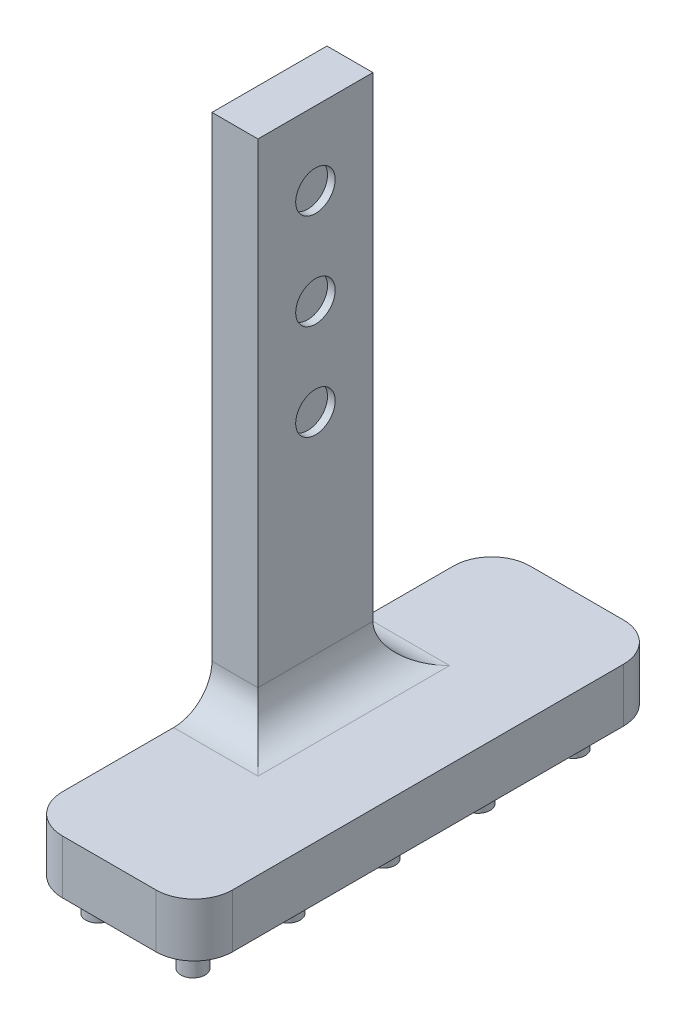
ISO-10303-21;
HEADER;
FILE_DESCRIPTION(('STEP AP214'),'2;1');
FILE_NAME('part.step','',(''),(''),'','','');
FILE_SCHEMA(('AUTOMOTIVE_DESIGN { 1 0 10303 214 1 1 1 1 }'));
ENDSEC;
DATA;
#1=APPLICATION_CONTEXT('core data for automotive mechanical design processes');
#2=APPLICATION_PROTOCOL_DEFINITION('international standard','automotive_design',2000,#1);
#3=PRODUCT_CONTEXT('',#1,'mechanical');
#4=PRODUCT('Part','Part','',(#3));
#5=PRODUCT_RELATED_PRODUCT_CATEGORY('part','',(#4));
#6=PRODUCT_DEFINITION_FORMATION('','',#4);
#7=PRODUCT_DEFINITION_CONTEXT('part definition',#1,'design');
#8=PRODUCT_DEFINITION('design','',#6,#7);
#9=PRODUCT_DEFINITION_SHAPE('','',#8);
#10=(LENGTH_UNIT() NAMED_UNIT(*) SI_UNIT(.MILLI.,.METRE.));
#11=(NAMED_UNIT(*) PLANE_ANGLE_UNIT() SI_UNIT($,.RADIAN.));
#12=(NAMED_UNIT(*) SI_UNIT($,.STERADIAN.) SOLID_ANGLE_UNIT());
#13=UNCERTAINTY_MEASURE_WITH_UNIT(LENGTH_MEASURE(1.E-05),#10,'distance_accuracy_value','');
#14=(GEOMETRIC_REPRESENTATION_CONTEXT(3) GLOBAL_UNCERTAINTY_ASSIGNED_CONTEXT((#13)) GLOBAL_UNIT_ASSIGNED_CONTEXT((#10,
#11,#12)) REPRESENTATION_CONTEXT('',''));
#15=CARTESIAN_POINT('',(0.,0.,0.));
#16=DIRECTION('',(0.,0.,1.));
#17=DIRECTION('',(1.,0.,0.));
#18=AXIS2_PLACEMENT_3D('',#15,#16,#17);
#19=CARTESIAN_POINT('',(0.,3.43841336116911,0.));
#20=DIRECTION('',(0.,-1.,0.));
#21=DIRECTION('',(0.,0.,-1.));
#22=AXIS2_PLACEMENT_3D('',#19,#20,#21);
#23=PLANE('',#22);
#24=DIRECTION('',(0.,0.,1.));
#25=VECTOR('',#24,1.);
#26=CARTESIAN_POINT('',(54.0829021375821,3.43841336116911,80.));
#27=LINE('',#26,#25);
#28=CARTESIAN_POINT('',(54.0829021375821,3.43841336116911,40.9091006022906));
#29=VERTEX_POINT('',#28);
#30=CARTESIAN_POINT('',(54.0829021375821,3.43841336116911,142.909100602291));
#31=VERTEX_POINT('',#30);
#32=EDGE_CURVE('E320',#29,#31,#27,.T.);
#33=ORIENTED_EDGE('',*,*,#32,.F.);
#34=CARTESIAN_POINT('',(44.0829021375821,3.43841336116911,40.9091006022906));
#35=DIRECTION('',(0.,-1.,0.));
#36=DIRECTION('',(0.,0.,-1.));
#37=AXIS2_PLACEMENT_3D('',#34,#35,#36);
#38=CIRCLE('',#37,10.);
#39=CARTESIAN_POINT('',(44.0829021375821,3.43841336116911,30.9091006022906));
#40=VERTEX_POINT('',#39);
#41=EDGE_CURVE('E11',#29,#40,#38,.F.);
#42=ORIENTED_EDGE('',*,*,#41,.T.);
#43=DIRECTION('',(1.,0.,0.));
#44=VECTOR('',#43,1.);
#45=CARTESIAN_POINT('',(9.70375407203342,3.43841336116911,30.9091006022906));
#46=LINE('',#45,#44);
#47=CARTESIAN_POINT('',(19.7037540720334,3.43841336116911,30.9091006022906));
#48=VERTEX_POINT('',#47);
#49=EDGE_CURVE('E185',#48,#40,#46,.T.);
#50=ORIENTED_EDGE('',*,*,#49,.F.);
#51=CARTESIAN_POINT('',(19.7037540720334,3.43841336116911,40.9091006022906));
#52=DIRECTION('',(0.,-1.,0.));
#53=DIRECTION('',(0.,0.,-1.));
#54=AXIS2_PLACEMENT_3D('',#51,#52,#53);
#55=CIRCLE('',#54,10.);
#56=CARTESIAN_POINT('',(9.70375407203342,3.43841336116911,40.9091006022906));
#57=VERTEX_POINT('',#56);
#58=EDGE_CURVE('E263',#48,#57,#55,.F.);
#59=ORIENTED_EDGE('',*,*,#58,.T.);
#60=DIRECTION('',(0.,0.,1.));
#61=VECTOR('',#60,1.);
#62=CARTESIAN_POINT('',(9.70375407203342,3.43841336116911,34.9091006022906));
#63=LINE('',#62,#61);
#64=CARTESIAN_POINT('',(9.70375407203342,3.43841336116911,63.9091006022906));
#65=VERTEX_POINT('',#64);
#66=EDGE_CURVE('E209',#57,#65,#63,.T.);
#67=ORIENTED_EDGE('',*,*,#66,.T.);
#68=DIRECTION('',(1.,0.,0.));
#69=VECTOR('',#68,1.);
#70=CARTESIAN_POINT('',(0.,3.43841336116911,63.9091006022906));
#71=LINE('',#70,#69);
#72=CARTESIAN_POINT('',(31.7037540720334,3.43841336116911,63.9091006022906));
#73=VERTEX_POINT('',#72);
#74=EDGE_CURVE('E225',#65,#73,#71,.T.);
#75=ORIENTED_EDGE('',*,*,#74,.T.);
#76=DIRECTION('',(0.,0.,-1.));
#77=VECTOR('',#76,1.);
#78=CARTESIAN_POINT('',(31.7037540720334,3.43841336116911,113.909100602291));
#79=LINE('',#78,#77);
#80=CARTESIAN_POINT('',(31.7037540720334,3.43841336116911,113.909100602291));
#81=VERTEX_POINT('',#80);
#82=EDGE_CURVE('E238',#73,#81,#79,.F.);
#83=ORIENTED_EDGE('',*,*,#82,.T.);
#84=DIRECTION('',(-1.,0.,0.));
#85=VECTOR('',#84,1.);
#86=CARTESIAN_POINT('',(0.,3.43841336116911,113.909100602291));
#87=LINE('',#86,#85);
#88=CARTESIAN_POINT('',(9.70375407203342,3.43841336116911,113.909100602291));
#89=VERTEX_POINT('',#88);
#90=EDGE_CURVE('E216',#81,#89,#87,.T.);
#91=ORIENTED_EDGE('',*,*,#90,.T.);
#92=CARTESIAN_POINT('',(9.70375407203343,3.43841336116911,142.909100602291));
#93=VERTEX_POINT('',#92);
#94=EDGE_CURVE('E208',#89,#93,#63,.T.);
#95=ORIENTED_EDGE('',*,*,#94,.T.);
#96=CARTESIAN_POINT('',(19.7037540720334,3.43841336116911,142.909100602291));
#97=DIRECTION('',(0.,-1.,0.));
#98=DIRECTION('',(0.,0.,-1.));
#99=AXIS2_PLACEMENT_3D('',#96,#97,#98);
#100=CIRCLE('',#99,10.);
#101=CARTESIAN_POINT('',(19.7037540720334,3.43841336116911,152.909100602291));
#102=VERTEX_POINT('',#101);
#103=EDGE_CURVE('E256',#93,#102,#100,.F.);
#104=ORIENTED_EDGE('',*,*,#103,.T.);
#105=DIRECTION('',(1.,0.,0.));
#106=VECTOR('',#105,1.);
#107=CARTESIAN_POINT('',(69.7037540720334,3.43841336116911,152.909100602291));
#108=LINE('',#107,#106);
#109=CARTESIAN_POINT('',(44.0829021375821,3.43841336116911,152.909100602291));
#110=VERTEX_POINT('',#109);
#111=EDGE_CURVE('E212',#102,#110,#108,.T.);
#112=ORIENTED_EDGE('',*,*,#111,.T.);
#113=CARTESIAN_POINT('',(44.0829021375821,3.43841336116911,142.909100602291));
#114=DIRECTION('',(0.,-1.,0.));
#115=DIRECTION('',(0.,0.,-1.));
#116=AXIS2_PLACEMENT_3D('',#113,#114,#115);
#117=CIRCLE('',#116,10.);
#118=EDGE_CURVE('E259',#110,#31,#117,.F.);
#119=ORIENTED_EDGE('',*,*,#118,.T.);
#120=EDGE_LOOP('',(#33,#42,#50,#59,#67,#75,#83,#91,#95,#104,#112,#119));
#121=FACE_BOUND('',#120,.T.);
#122=ADVANCED_FACE('F51',(#121),#23,.F.);
#123=CARTESIAN_POINT('',(0.,-10.5615866388309,0.));
#124=DIRECTION('',(0.,-1.,0.));
#125=DIRECTION('',(0.,0.,-1.));
#126=AXIS2_PLACEMENT_3D('',#123,#124,#125);
#127=PLANE('',#126);
#128=CARTESIAN_POINT('',(20.7944408655817,-10.5615866388309,144.754532871592));
#129=DIRECTION('',(0.,-1.,0.));
#130=DIRECTION('',(0.,0.,-1.));
#131=AXIS2_PLACEMENT_3D('',#128,#129,#130);
#132=CIRCLE('',#131,3.15);
#133=CARTESIAN_POINT('',(20.7944408655817,-10.5615866388309,141.604532871592));
#134=VERTEX_POINT('',#133);
#135=EDGE_CURVE('E340',#134,#134,#132,.T.);
#136=ORIENTED_EDGE('',*,*,#135,.F.);
#137=EDGE_LOOP('',(#136));
#138=FACE_BOUND('',#137,.T.);
#139=CARTESIAN_POINT('',(45.5944408655817,-10.5615866388309,144.754532871592));
#140=DIRECTION('',(0.,-1.,0.));
#141=DIRECTION('',(0.,0.,-1.));
#142=AXIS2_PLACEMENT_3D('',#139,#140,#141);
#143=CIRCLE('',#142,3.15);
#144=CARTESIAN_POINT('',(45.5944408655817,-10.5615866388309,141.604532871592));
#145=VERTEX_POINT('',#144);
#146=EDGE_CURVE('E345',#145,#145,#143,.T.);
#147=ORIENTED_EDGE('',*,*,#146,.F.);
#148=EDGE_LOOP('',(#147));
#149=FACE_BOUND('',#148,.T.);
#150=CARTESIAN_POINT('',(45.594440865582,-10.5615866388309,119.954532871592));
#151=DIRECTION('',(0.,-1.,0.));
#152=DIRECTION('',(0.,0.,-1.));
#153=AXIS2_PLACEMENT_3D('',#150,#151,#152);
#154=CIRCLE('',#153,3.15);
#155=CARTESIAN_POINT('',(45.594440865582,-10.5615866388309,116.804532871592));
#156=VERTEX_POINT('',#155);
#157=EDGE_CURVE('E351',#156,#156,#154,.T.);
#158=ORIENTED_EDGE('',*,*,#157,.F.);
#159=EDGE_LOOP('',(#158));
#160=FACE_BOUND('',#159,.T.);
#161=CARTESIAN_POINT('',(45.5944408655822,-10.5615866388309,95.1545328715916));
#162=DIRECTION('',(0.,-1.,0.));
#163=DIRECTION('',(0.,0.,-1.));
#164=AXIS2_PLACEMENT_3D('',#161,#162,#163);
#165=CIRCLE('',#164,3.15);
#166=CARTESIAN_POINT('',(45.5944408655822,-10.5615866388309,92.0045328715916));
#167=VERTEX_POINT('',#166);
#168=EDGE_CURVE('E359',#167,#167,#165,.T.);
#169=ORIENTED_EDGE('',*,*,#168,.F.);
#170=EDGE_LOOP('',(#169));
#171=FACE_BOUND('',#170,.T.);
#172=CARTESIAN_POINT('',(45.5944408655825,-10.5615866388309,70.3545328715916));
#173=DIRECTION('',(0.,-1.,0.));
#174=DIRECTION('',(0.,0.,-1.));
#175=AXIS2_PLACEMENT_3D('',#172,#173,#174);
#176=CIRCLE('',#175,3.15);
#177=CARTESIAN_POINT('',(45.5944408655825,-10.5615866388309,67.2045328715916));
#178=VERTEX_POINT('',#177);
#179=EDGE_CURVE('E367',#178,#178,#176,.T.);
#180=ORIENTED_EDGE('',*,*,#179,.F.);
#181=EDGE_LOOP('',(#180));
#182=FACE_BOUND('',#181,.T.);
#183=CARTESIAN_POINT('',(45.5944408655827,-10.5615866388309,45.5545328715916));
#184=DIRECTION('',(0.,-1.,0.));
#185=DIRECTION('',(0.,0.,-1.));
#186=AXIS2_PLACEMENT_3D('',#183,#184,#185);
#187=CIRCLE('',#186,3.15);
#188=CARTESIAN_POINT('',(45.5944408655827,-10.5615866388309,42.4045328715916));
#189=VERTEX_POINT('',#188);
#190=EDGE_CURVE('E375',#189,#189,#187,.T.);
#191=ORIENTED_EDGE('',*,*,#190,.F.);
#192=EDGE_LOOP('',(#191));
#193=FACE_BOUND('',#192,.T.);
#194=CARTESIAN_POINT('',(20.794440865582,-10.5615866388309,119.954532871592));
#195=DIRECTION('',(0.,-1.,0.));
#196=DIRECTION('',(0.,0.,-1.));
#197=AXIS2_PLACEMENT_3D('',#194,#195,#196);
#198=CIRCLE('',#197,3.15);
#199=CARTESIAN_POINT('',(20.794440865582,-10.5615866388309,116.804532871592));
#200=VERTEX_POINT('',#199);
#201=EDGE_CURVE('E383',#200,#200,#198,.T.);
#202=ORIENTED_EDGE('',*,*,#201,.F.);
#203=EDGE_LOOP('',(#202));
#204=FACE_BOUND('',#203,.T.);
#205=CARTESIAN_POINT('',(20.7944408655822,-10.5615866388309,95.1545328715916));
#206=DIRECTION('',(0.,-1.,0.));
#207=DIRECTION('',(0.,0.,-1.));
#208=AXIS2_PLACEMENT_3D('',#205,#206,#207);
#209=CIRCLE('',#208,3.15);
#210=CARTESIAN_POINT('',(20.7944408655822,-10.5615866388309,92.0045328715916));
#211=VERTEX_POINT('',#210);
#212=EDGE_CURVE('E391',#211,#211,#209,.T.);
#213=ORIENTED_EDGE('',*,*,#212,.F.);
#214=EDGE_LOOP('',(#213));
#215=FACE_BOUND('',#214,.T.);
#216=CARTESIAN_POINT('',(20.7944408655825,-10.5615866388309,70.3545328715916));
#217=DIRECTION('',(0.,-1.,0.));
#218=DIRECTION('',(0.,0.,-1.));
#219=AXIS2_PLACEMENT_3D('',#216,#217,#218);
#220=CIRCLE('',#219,3.15);
#221=CARTESIAN_POINT('',(20.7944408655825,-10.5615866388309,67.2045328715916));
#222=VERTEX_POINT('',#221);
#223=EDGE_CURVE('E399',#222,#222,#220,.T.);
#224=ORIENTED_EDGE('',*,*,#223,.F.);
#225=EDGE_LOOP('',(#224));
#226=FACE_BOUND('',#225,.T.);
#227=CARTESIAN_POINT('',(20.7944408655828,-10.5615866388309,45.5545328715916));
#228=DIRECTION('',(0.,-1.,0.));
#229=DIRECTION('',(0.,0.,-1.));
#230=AXIS2_PLACEMENT_3D('',#227,#228,#229);
#231=CIRCLE('',#230,3.15);
#232=CARTESIAN_POINT('',(20.7944408655828,-10.5615866388309,42.4045328715916));
#233=VERTEX_POINT('',#232);
#234=EDGE_CURVE('E407',#233,#233,#231,.T.);
#235=ORIENTED_EDGE('',*,*,#234,.F.);
#236=EDGE_LOOP('',(#235));
#237=FACE_BOUND('',#236,.T.);
#238=DIRECTION('',(-1.,0.,0.));
#239=VECTOR('',#238,1.);
#240=CARTESIAN_POINT('',(115.522386605031,-10.5615866388309,30.9091006022906));
#241=LINE('',#240,#239);
#242=CARTESIAN_POINT('',(44.0829021375821,-10.5615866388309,30.9091006022906));
#243=VERTEX_POINT('',#242);
#244=CARTESIAN_POINT('',(19.7037540720334,-10.5615866388309,30.9091006022906));
#245=VERTEX_POINT('',#244);
#246=EDGE_CURVE('E332',#243,#245,#241,.T.);
#247=ORIENTED_EDGE('',*,*,#246,.F.);
#248=CARTESIAN_POINT('',(44.0829021375821,-10.5615866388309,40.9091006022906));
#249=DIRECTION('',(0.,-1.,0.));
#250=DIRECTION('',(0.,0.,-1.));
#251=AXIS2_PLACEMENT_3D('',#248,#249,#250);
#252=CIRCLE('',#251,10.);
#253=CARTESIAN_POINT('',(54.0829021375821,-10.5615866388309,40.9091006022906));
#254=VERTEX_POINT('',#253);
#255=EDGE_CURVE('E74',#243,#254,#252,.T.);
#256=ORIENTED_EDGE('',*,*,#255,.T.);
#257=DIRECTION('',(0.,0.,-1.));
#258=VECTOR('',#257,1.);
#259=CARTESIAN_POINT('',(54.0829021375821,-10.5615866388309,0.));
#260=LINE('',#259,#258);
#261=CARTESIAN_POINT('',(54.0829021375821,-10.5615866388309,142.909100602291));
#262=VERTEX_POINT('',#261);
#263=EDGE_CURVE('E249',#262,#254,#260,.T.);
#264=ORIENTED_EDGE('',*,*,#263,.F.);
#265=CARTESIAN_POINT('',(44.0829021375821,-10.5615866388309,142.909100602291));
#266=DIRECTION('',(0.,-1.,0.));
#267=DIRECTION('',(0.,0.,-1.));
#268=AXIS2_PLACEMENT_3D('',#265,#266,#267);
#269=CIRCLE('',#268,10.);
#270=CARTESIAN_POINT('',(44.0829021375821,-10.5615866388309,152.909100602291));
#271=VERTEX_POINT('',#270);
#272=EDGE_CURVE('E275',#262,#271,#269,.T.);
#273=ORIENTED_EDGE('',*,*,#272,.T.);
#274=DIRECTION('',(-1.,0.,0.));
#275=VECTOR('',#274,1.);
#276=CARTESIAN_POINT('',(69.7037540720334,-10.5615866388309,152.909100602291));
#277=LINE('',#276,#275);
#278=CARTESIAN_POINT('',(19.7037540720334,-10.5615866388309,152.909100602291));
#279=VERTEX_POINT('',#278);
#280=EDGE_CURVE('E166',#271,#279,#277,.T.);
#281=ORIENTED_EDGE('',*,*,#280,.T.);
#282=CARTESIAN_POINT('',(19.7037540720334,-10.5615866388309,142.909100602291));
#283=DIRECTION('',(0.,-1.,0.));
#284=DIRECTION('',(0.,0.,-1.));
#285=AXIS2_PLACEMENT_3D('',#282,#283,#284);
#286=CIRCLE('',#285,10.);
#287=CARTESIAN_POINT('',(9.70375407203343,-10.5615866388309,142.909100602291));
#288=VERTEX_POINT('',#287);
#289=EDGE_CURVE('E272',#279,#288,#286,.T.);
#290=ORIENTED_EDGE('',*,*,#289,.T.);
#291=DIRECTION('',(0.,0.,-1.));
#292=VECTOR('',#291,1.);
#293=CARTESIAN_POINT('',(9.70375407203343,-10.5615866388309,152.909100602291));
#294=LINE('',#293,#292);
#295=CARTESIAN_POINT('',(9.70375407203342,-10.5615866388309,40.9091006022906));
#296=VERTEX_POINT('',#295);
#297=EDGE_CURVE('E204',#288,#296,#294,.T.);
#298=ORIENTED_EDGE('',*,*,#297,.T.);
#299=CARTESIAN_POINT('',(19.7037540720334,-10.5615866388309,40.9091006022906));
#300=DIRECTION('',(0.,-1.,0.));
#301=DIRECTION('',(0.,0.,-1.));
#302=AXIS2_PLACEMENT_3D('',#299,#300,#301);
#303=CIRCLE('',#302,10.);
#304=EDGE_CURVE('E278',#296,#245,#303,.T.);
#305=ORIENTED_EDGE('',*,*,#304,.T.);
#306=EDGE_LOOP('',(#247,#256,#264,#273,#281,#290,#298,#305));
#307=FACE_BOUND('',#306,.T.);
#308=ADVANCED_FACE('F314',(#138,#149,#160,#171,#182,#193,#204,#215,#226,#237,#307),#127,.T.);
#309=CARTESIAN_POINT('',(0.,0.,30.9091006022906));
#310=DIRECTION('',(0.,0.,-1.));
#311=DIRECTION('',(-1.,0.,0.));
#312=AXIS2_PLACEMENT_3D('',#309,#310,#311);
#313=PLANE('',#312);
#314=ORIENTED_EDGE('',*,*,#49,.T.);
#315=DIRECTION('',(0.,-1.,0.));
#316=VECTOR('',#315,1.);
#317=CARTESIAN_POINT('',(44.0829021375821,-10.5615866388309,30.9091006022906));
#318=LINE('',#317,#316);
#319=EDGE_CURVE('E293',#40,#243,#318,.T.);
#320=ORIENTED_EDGE('',*,*,#319,.T.);
#321=ORIENTED_EDGE('',*,*,#246,.T.);
#322=DIRECTION('',(0.,1.,0.));
#323=VECTOR('',#322,1.);
#324=CARTESIAN_POINT('',(19.7037540720334,3.43841336116911,30.9091006022906));
#325=LINE('',#324,#323);
#326=EDGE_CURVE('E252',#245,#48,#325,.T.);
#327=ORIENTED_EDGE('',*,*,#326,.T.);
#328=EDGE_LOOP('',(#314,#320,#321,#327));
#329=FACE_BOUND('',#328,.T.);
#330=ADVANCED_FACE('F331',(#329),#313,.T.);
#331=CARTESIAN_POINT('',(9.70375407203342,3.43841336116911,34.9091006022906));
#332=DIRECTION('',(1.,0.,0.));
#333=DIRECTION('',(0.,0.,-1.));
#334=AXIS2_PLACEMENT_3D('',#331,#332,#333);
#335=PLANE('',#334);
#336=ORIENTED_EDGE('',*,*,#66,.F.);
#337=DIRECTION('',(0.,1.,0.));
#338=VECTOR('',#337,1.);
#339=CARTESIAN_POINT('',(9.70375407203342,-10.5615866388309,40.9091006022906));
#340=LINE('',#339,#338);
#341=EDGE_CURVE('E269',#57,#296,#340,.F.);
#342=ORIENTED_EDGE('',*,*,#341,.T.);
#343=ORIENTED_EDGE('',*,*,#297,.F.);
#344=DIRECTION('',(0.,-1.,0.));
#345=VECTOR('',#344,1.);
#346=CARTESIAN_POINT('',(9.70375407203343,3.43841336116911,142.909100602291));
#347=LINE('',#346,#345);
#348=EDGE_CURVE('E266',#288,#93,#347,.F.);
#349=ORIENTED_EDGE('',*,*,#348,.T.);
#350=ORIENTED_EDGE('',*,*,#94,.F.);
#351=CARTESIAN_POINT('',(9.70375407203342,13.4384133611691,113.909100602291));
#352=DIRECTION('',(1.,0.,0.));
#353=DIRECTION('',(0.,0.,-1.));
#354=AXIS2_PLACEMENT_3D('',#351,#352,#353);
#355=CIRCLE('',#354,10.);
#356=CARTESIAN_POINT('',(9.70375407203342,13.4384133611691,103.909100602291));
#357=VERTEX_POINT('',#356);
#358=EDGE_CURVE('E222',#89,#357,#355,.T.);
#359=ORIENTED_EDGE('',*,*,#358,.T.);
#360=DIRECTION('',(0.,1.,0.));
#361=VECTOR('',#360,1.);
#362=CARTESIAN_POINT('',(9.70375407203342,5.46538009817361,103.909100602291));
#363=LINE('',#362,#361);
#364=CARTESIAN_POINT('',(9.70375407203342,137.438413361169,103.909100602291));
#365=VERTEX_POINT('',#364);
#366=EDGE_CURVE('E194',#357,#365,#363,.T.);
#367=ORIENTED_EDGE('',*,*,#366,.T.);
#368=DIRECTION('',(0.,0.,-1.));
#369=VECTOR('',#368,1.);
#370=CARTESIAN_POINT('',(9.70375407203342,137.438413361169,73.9091006022906));
#371=LINE('',#370,#369);
#372=CARTESIAN_POINT('',(9.70375407203342,137.438413361169,73.9091006022906));
#373=VERTEX_POINT('',#372);
#374=EDGE_CURVE('E175',#365,#373,#371,.T.);
#375=ORIENTED_EDGE('',*,*,#374,.T.);
#376=DIRECTION('',(0.,-1.,0.));
#377=VECTOR('',#376,1.);
#378=CARTESIAN_POINT('',(9.70375407203342,5.46538009817361,73.9091006022906));
#379=LINE('',#378,#377);
#380=CARTESIAN_POINT('',(9.70375407203342,13.4384133611691,73.9091006022906));
#381=VERTEX_POINT('',#380);
#382=EDGE_CURVE('E191',#373,#381,#379,.T.);
#383=ORIENTED_EDGE('',*,*,#382,.T.);
#384=CARTESIAN_POINT('',(9.70375407203342,13.4384133611691,63.9091006022906));
#385=DIRECTION('',(1.,0.,0.));
#386=DIRECTION('',(0.,0.,-1.));
#387=AXIS2_PLACEMENT_3D('',#384,#385,#386);
#388=CIRCLE('',#387,10.);
#389=EDGE_CURVE('E231',#381,#65,#388,.T.);
#390=ORIENTED_EDGE('',*,*,#389,.T.);
#391=EDGE_LOOP('',(#336,#342,#343,#349,#350,#359,#367,#375,#383,#390));
#392=FACE_BOUND('',#391,.T.);
#393=ADVANCED_FACE('F484',(#392),#335,.F.);
#394=CARTESIAN_POINT('',(69.7037540720334,3.43841336116911,152.909100602291));
#395=DIRECTION('',(0.,0.,-1.));
#396=DIRECTION('',(-1.,0.,0.));
#397=AXIS2_PLACEMENT_3D('',#394,#395,#396);
#398=PLANE('',#397);
#399=ORIENTED_EDGE('',*,*,#280,.F.);
#400=DIRECTION('',(0.,1.,0.));
#401=VECTOR('',#400,1.);
#402=CARTESIAN_POINT('',(44.0829021375821,3.43841336116911,152.909100602291));
#403=LINE('',#402,#401);
#404=EDGE_CURVE('E286',#271,#110,#403,.T.);
#405=ORIENTED_EDGE('',*,*,#404,.T.);
#406=ORIENTED_EDGE('',*,*,#111,.F.);
#407=DIRECTION('',(0.,-1.,0.));
#408=VECTOR('',#407,1.);
#409=CARTESIAN_POINT('',(19.7037540720334,3.43841336116911,152.909100602291));
#410=LINE('',#409,#408);
#411=EDGE_CURVE('E282',#102,#279,#410,.T.);
#412=ORIENTED_EDGE('',*,*,#411,.T.);
#413=EDGE_LOOP('',(#399,#405,#406,#412));
#414=FACE_BOUND('',#413,.T.);
#415=ADVANCED_FACE('F312',(#414),#398,.F.);
#416=CARTESIAN_POINT('',(21.7037540720334,5.46538009817361,73.9091006022906));
#417=DIRECTION('',(0.,0.,-1.));
#418=DIRECTION('',(-1.,0.,0.));
#419=AXIS2_PLACEMENT_3D('',#416,#417,#418);
#420=PLANE('',#419);
#421=DIRECTION('',(0.,-1.,0.));
#422=VECTOR('',#421,1.);
#423=CARTESIAN_POINT('',(21.7037540720334,5.46538009817361,73.9091006022906));
#424=LINE('',#423,#422);
#425=CARTESIAN_POINT('',(21.7037540720334,137.438413361169,73.9091006022906));
#426=VERTEX_POINT('',#425);
#427=CARTESIAN_POINT('',(21.7037540720334,13.4384133611691,73.9091006022906));
#428=VERTEX_POINT('',#427);
#429=EDGE_CURVE('E167',#426,#428,#424,.T.);
#430=ORIENTED_EDGE('',*,*,#429,.T.);
#431=DIRECTION('',(1.,0.,0.));
#432=VECTOR('',#431,1.);
#433=CARTESIAN_POINT('',(21.7037540720334,13.4384133611691,73.9091006022906));
#434=LINE('',#433,#432);
#435=EDGE_CURVE('E228',#428,#381,#434,.F.);
#436=ORIENTED_EDGE('',*,*,#435,.T.);
#437=ORIENTED_EDGE('',*,*,#382,.F.);
#438=DIRECTION('',(-1.,0.,0.));
#439=VECTOR('',#438,1.);
#440=CARTESIAN_POINT('',(21.7037540720334,137.438413361169,73.9091006022906));
#441=LINE('',#440,#439);
#442=EDGE_CURVE('E177',#426,#373,#441,.T.);
#443=ORIENTED_EDGE('',*,*,#442,.F.);
#444=EDGE_LOOP('',(#430,#436,#437,#443));
#445=FACE_BOUND('',#444,.T.);
#446=ADVANCED_FACE('F483',(#445),#420,.T.);
#447=CARTESIAN_POINT('',(21.7037540720334,5.46538009817361,103.909100602291));
#448=DIRECTION('',(0.,0.,1.));
#449=DIRECTION('',(1.,0.,0.));
#450=AXIS2_PLACEMENT_3D('',#447,#448,#449);
#451=PLANE('',#450);
#452=ORIENTED_EDGE('',*,*,#366,.F.);
#453=DIRECTION('',(-1.,0.,0.));
#454=VECTOR('',#453,1.);
#455=CARTESIAN_POINT('',(21.7037540720334,13.4384133611691,103.909100602291));
#456=LINE('',#455,#454);
#457=CARTESIAN_POINT('',(21.7037540720334,13.4384133611691,103.909100602291));
#458=VERTEX_POINT('',#457);
#459=EDGE_CURVE('E160',#357,#458,#456,.F.);
#460=ORIENTED_EDGE('',*,*,#459,.T.);
#461=DIRECTION('',(0.,1.,0.));
#462=VECTOR('',#461,1.);
#463=CARTESIAN_POINT('',(21.7037540720334,5.46538009817361,103.909100602291));
#464=LINE('',#463,#462);
#465=CARTESIAN_POINT('',(21.7037540720334,137.438413361169,103.909100602291));
#466=VERTEX_POINT('',#465);
#467=EDGE_CURVE('E153',#458,#466,#464,.T.);
#468=ORIENTED_EDGE('',*,*,#467,.T.);
#469=DIRECTION('',(-1.,0.,0.));
#470=VECTOR('',#469,1.);
#471=CARTESIAN_POINT('',(21.7037540720334,137.438413361169,103.909100602291));
#472=LINE('',#471,#470);
#473=EDGE_CURVE('E157',#466,#365,#472,.T.);
#474=ORIENTED_EDGE('',*,*,#473,.T.);
#475=EDGE_LOOP('',(#452,#460,#468,#474));
#476=FACE_BOUND('',#475,.T.);
#477=ADVANCED_FACE('F156',(#476),#451,.T.);
#478=CARTESIAN_POINT('',(21.7037540720334,0.,0.));
#479=DIRECTION('',(-1.,0.,0.));
#480=DIRECTION('',(0.,0.,1.));
#481=AXIS2_PLACEMENT_3D('',#478,#479,#480);
#482=PLANE('',#481);
#483=CARTESIAN_POINT('',(21.7037540720334,118.23031217153,88.9091006022906));
#484=DIRECTION('',(1.,0.,0.));
#485=DIRECTION('',(0.,0.,-1.));
#486=AXIS2_PLACEMENT_3D('',#483,#484,#485);
#487=CIRCLE('',#486,5.15);
#488=CARTESIAN_POINT('',(21.7037540720334,118.23031217153,83.7591006022906));
#489=VERTEX_POINT('',#488);
#490=EDGE_CURVE('E433',#489,#489,#487,.T.);
#491=ORIENTED_EDGE('',*,*,#490,.F.);
#492=EDGE_LOOP('',(#491));
#493=FACE_BOUND('',#492,.T.);
#494=CARTESIAN_POINT('',(21.7037540720334,93.2303121715304,88.9091006022903));
#495=DIRECTION('',(1.,0.,0.));
#496=DIRECTION('',(0.,0.,-1.));
#497=AXIS2_PLACEMENT_3D('',#494,#495,#496);
#498=CIRCLE('',#497,5.14999999999999);
#499=CARTESIAN_POINT('',(21.7037540720334,93.2303121715304,83.7591006022903));
#500=VERTEX_POINT('',#499);
#501=EDGE_CURVE('E429',#500,#500,#498,.T.);
#502=ORIENTED_EDGE('',*,*,#501,.F.);
#503=EDGE_LOOP('',(#502));
#504=FACE_BOUND('',#503,.T.);
#505=CARTESIAN_POINT('',(21.7037540720334,68.2303121715304,88.9091006022901));
#506=DIRECTION('',(1.,0.,0.));
#507=DIRECTION('',(0.,0.,-1.));
#508=AXIS2_PLACEMENT_3D('',#505,#506,#507);
#509=CIRCLE('',#508,5.15);
#510=CARTESIAN_POINT('',(21.7037540720334,68.2303121715304,83.75910060229));
#511=VERTEX_POINT('',#510);
#512=EDGE_CURVE('E421',#511,#511,#509,.T.);
#513=ORIENTED_EDGE('',*,*,#512,.F.);
#514=EDGE_LOOP('',(#513));
#515=FACE_BOUND('',#514,.T.);
#516=ORIENTED_EDGE('',*,*,#467,.F.);
#517=DIRECTION('',(0.,0.,-1.));
#518=VECTOR('',#517,1.);
#519=CARTESIAN_POINT('',(21.7037540720334,13.4384133611691,63.9091006022906));
#520=LINE('',#519,#518);
#521=EDGE_CURVE('E235',#458,#428,#520,.T.);
#522=ORIENTED_EDGE('',*,*,#521,.T.);
#523=ORIENTED_EDGE('',*,*,#429,.F.);
#524=DIRECTION('',(0.,0.,-1.));
#525=VECTOR('',#524,1.);
#526=CARTESIAN_POINT('',(21.7037540720334,137.438413361169,73.9091006022906));
#527=LINE('',#526,#525);
#528=EDGE_CURVE('E173',#466,#426,#527,.T.);
#529=ORIENTED_EDGE('',*,*,#528,.F.);
#530=EDGE_LOOP('',(#516,#522,#523,#529));
#531=FACE_BOUND('',#530,.T.);
#532=ADVANCED_FACE('F179',(#493,#504,#515,#531),#482,.F.);
#533=CARTESIAN_POINT('',(21.7037540720334,137.438413361169,73.9091006022906));
#534=DIRECTION('',(0.,1.,0.));
#535=DIRECTION('',(0.,0.,1.));
#536=AXIS2_PLACEMENT_3D('',#533,#534,#535);
#537=PLANE('',#536);
#538=ORIENTED_EDGE('',*,*,#374,.F.);
#539=ORIENTED_EDGE('',*,*,#473,.F.);
#540=ORIENTED_EDGE('',*,*,#528,.T.);
#541=ORIENTED_EDGE('',*,*,#442,.T.);
#542=EDGE_LOOP('',(#538,#539,#540,#541));
#543=FACE_BOUND('',#542,.T.);
#544=ADVANCED_FACE('F171',(#543),#537,.T.);
#545=CARTESIAN_POINT('',(0.,13.4384133611691,113.909100602291));
#546=DIRECTION('',(-1.,0.,0.));
#547=DIRECTION('',(0.,0.,1.));
#548=AXIS2_PLACEMENT_3D('',#545,#546,#547);
#549=CYLINDRICAL_SURFACE('',#548,10.);
#550=ORIENTED_EDGE('',*,*,#90,.F.);
#551=CARTESIAN_POINT('',(31.7037540720334,13.4384133611691,113.909100602291));
#552=DIRECTION('',(-0.707106781186547,0.,0.707106781186548));
#553=DIRECTION('',(-0.707106781186548,0.,-0.707106781186547));
#554=AXIS2_PLACEMENT_3D('',#551,#552,#553);
#555=ELLIPSE('',#554,14.1421356237309,10.);
#556=EDGE_CURVE('E246',#81,#458,#555,.F.);
#557=ORIENTED_EDGE('',*,*,#556,.T.);
#558=ORIENTED_EDGE('',*,*,#459,.F.);
#559=ORIENTED_EDGE('',*,*,#358,.F.);
#560=EDGE_LOOP('',(#550,#557,#558,#559));
#561=FACE_BOUND('',#560,.T.);
#562=ADVANCED_FACE('F487',(#561),#549,.F.);
#563=CARTESIAN_POINT('',(0.,13.4384133611691,63.9091006022906));
#564=DIRECTION('',(1.,0.,0.));
#565=DIRECTION('',(0.,0.,-1.));
#566=AXIS2_PLACEMENT_3D('',#563,#564,#565);
#567=CYLINDRICAL_SURFACE('',#566,10.);
#568=ORIENTED_EDGE('',*,*,#389,.F.);
#569=ORIENTED_EDGE('',*,*,#435,.F.);
#570=CARTESIAN_POINT('',(31.7037540720334,13.4384133611691,63.9091006022906));
#571=DIRECTION('',(0.707106781186548,0.,0.707106781186547));
#572=DIRECTION('',(0.707106781186547,0.,-0.707106781186548));
#573=AXIS2_PLACEMENT_3D('',#570,#571,#572);
#574=ELLIPSE('',#573,14.1421356237309,10.);
#575=EDGE_CURVE('E242',#428,#73,#574,.T.);
#576=ORIENTED_EDGE('',*,*,#575,.T.);
#577=ORIENTED_EDGE('',*,*,#74,.F.);
#578=EDGE_LOOP('',(#568,#569,#576,#577));
#579=FACE_BOUND('',#578,.T.);
#580=ADVANCED_FACE('F490',(#579),#567,.F.);
#581=CARTESIAN_POINT('',(31.7037540720334,13.4384133611691,0.));
#582=DIRECTION('',(0.,0.,1.));
#583=DIRECTION('',(1.,0.,0.));
#584=AXIS2_PLACEMENT_3D('',#581,#582,#583);
#585=CYLINDRICAL_SURFACE('',#584,10.);
#586=ORIENTED_EDGE('',*,*,#556,.F.);
#587=ORIENTED_EDGE('',*,*,#82,.F.);
#588=ORIENTED_EDGE('',*,*,#575,.F.);
#589=ORIENTED_EDGE('',*,*,#521,.F.);
#590=EDGE_LOOP('',(#586,#587,#588,#589));
#591=FACE_BOUND('',#590,.T.);
#592=ADVANCED_FACE('F494',(#591),#585,.F.);
#593=CARTESIAN_POINT('',(20.7944408655817,-17.5615866388309,144.754532871592));
#594=DIRECTION('',(0.,1.,0.));
#595=DIRECTION('',(0.,0.,1.));
#596=AXIS2_PLACEMENT_3D('',#593,#594,#595);
#597=CYLINDRICAL_SURFACE('',#596,3.15);
#598=CARTESIAN_POINT('',(20.7944408655817,-17.5615866388309,144.754532871592));
#599=DIRECTION('',(0.,-1.,0.));
#600=DIRECTION('',(0.,0.,-1.));
#601=AXIS2_PLACEMENT_3D('',#598,#599,#600);
#602=CIRCLE('',#601,3.15);
#603=CARTESIAN_POINT('',(20.7944408655817,-17.5615866388309,141.604532871592));
#604=VERTEX_POINT('',#603);
#605=EDGE_CURVE('E336',#604,#604,#602,.T.);
#606=ORIENTED_EDGE('',*,*,#605,.F.);
#607=EDGE_LOOP('',(#606));
#608=FACE_BOUND('',#607,.T.);
#609=ORIENTED_EDGE('',*,*,#135,.T.);
#610=EDGE_LOOP('',(#609));
#611=FACE_BOUND('',#610,.T.);
#612=ADVANCED_FACE('F498',(#608,#611),#597,.T.);
#613=CARTESIAN_POINT('',(20.7944408655817,-17.5615866388309,144.754532871592));
#614=DIRECTION('',(0.,-1.,0.));
#615=DIRECTION('',(0.,0.,-1.));
#616=AXIS2_PLACEMENT_3D('',#613,#614,#615);
#617=PLANE('',#616);
#618=ORIENTED_EDGE('',*,*,#605,.T.);
#619=EDGE_LOOP('',(#618));
#620=FACE_BOUND('',#619,.T.);
#621=ADVANCED_FACE('F695',(#620),#617,.T.);
#622=CARTESIAN_POINT('',(45.5944408655817,-17.5615866388309,144.754532871592));
#623=DIRECTION('',(0.,1.,0.));
#624=DIRECTION('',(0.,0.,1.));
#625=AXIS2_PLACEMENT_3D('',#622,#623,#624);
#626=CYLINDRICAL_SURFACE('',#625,3.15);
#627=CARTESIAN_POINT('',(45.5944408655817,-17.5615866388309,144.754532871592));
#628=DIRECTION('',(0.,-1.,0.));
#629=DIRECTION('',(0.,0.,-1.));
#630=AXIS2_PLACEMENT_3D('',#627,#628,#629);
#631=CIRCLE('',#630,3.15);
#632=CARTESIAN_POINT('',(45.5944408655817,-17.5615866388309,141.604532871592));
#633=VERTEX_POINT('',#632);
#634=EDGE_CURVE('E347',#633,#633,#631,.T.);
#635=ORIENTED_EDGE('',*,*,#634,.F.);
#636=EDGE_LOOP('',(#635));
#637=FACE_BOUND('',#636,.T.);
#638=ORIENTED_EDGE('',*,*,#146,.T.);
#639=EDGE_LOOP('',(#638));
#640=FACE_BOUND('',#639,.T.);
#641=ADVANCED_FACE('F686',(#637,#640),#626,.T.);
#642=CARTESIAN_POINT('',(45.5944408655817,-17.5615866388309,144.754532871592));
#643=DIRECTION('',(0.,-1.,0.));
#644=DIRECTION('',(0.,0.,-1.));
#645=AXIS2_PLACEMENT_3D('',#642,#643,#644);
#646=PLANE('',#645);
#647=ORIENTED_EDGE('',*,*,#634,.T.);
#648=EDGE_LOOP('',(#647));
#649=FACE_BOUND('',#648,.T.);
#650=ADVANCED_FACE('F677',(#649),#646,.T.);
#651=CARTESIAN_POINT('',(45.594440865582,-17.5615866388309,119.954532871592));
#652=DIRECTION('',(0.,1.,0.));
#653=DIRECTION('',(0.,0.,1.));
#654=AXIS2_PLACEMENT_3D('',#651,#652,#653);
#655=CYLINDRICAL_SURFACE('',#654,3.15);
#656=CARTESIAN_POINT('',(45.594440865582,-17.5615866388309,119.954532871592));
#657=DIRECTION('',(0.,-1.,0.));
#658=DIRECTION('',(0.,0.,-1.));
#659=AXIS2_PLACEMENT_3D('',#656,#657,#658);
#660=CIRCLE('',#659,3.15);
#661=CARTESIAN_POINT('',(45.594440865582,-17.5615866388309,116.804532871592));
#662=VERTEX_POINT('',#661);
#663=EDGE_CURVE('E355',#662,#662,#660,.T.);
#664=ORIENTED_EDGE('',*,*,#663,.F.);
#665=EDGE_LOOP('',(#664));
#666=FACE_BOUND('',#665,.T.);
#667=ORIENTED_EDGE('',*,*,#157,.T.);
#668=EDGE_LOOP('',(#667));
#669=FACE_BOUND('',#668,.T.);
#670=ADVANCED_FACE('F668',(#666,#669),#655,.T.);
#671=CARTESIAN_POINT('',(45.594440865582,-17.5615866388309,119.954532871592));
#672=DIRECTION('',(0.,-1.,0.));
#673=DIRECTION('',(0.,0.,-1.));
#674=AXIS2_PLACEMENT_3D('',#671,#672,#673);
#675=PLANE('',#674);
#676=ORIENTED_EDGE('',*,*,#663,.T.);
#677=EDGE_LOOP('',(#676));
#678=FACE_BOUND('',#677,.T.);
#679=ADVANCED_FACE('F659',(#678),#675,.T.);
#680=CARTESIAN_POINT('',(45.5944408655822,-17.5615866388309,95.1545328715916));
#681=DIRECTION('',(0.,1.,0.));
#682=DIRECTION('',(0.,0.,1.));
#683=AXIS2_PLACEMENT_3D('',#680,#681,#682);
#684=CYLINDRICAL_SURFACE('',#683,3.15);
#685=CARTESIAN_POINT('',(45.5944408655822,-17.5615866388309,95.1545328715916));
#686=DIRECTION('',(0.,-1.,0.));
#687=DIRECTION('',(0.,0.,-1.));
#688=AXIS2_PLACEMENT_3D('',#685,#686,#687);
#689=CIRCLE('',#688,3.15);
#690=CARTESIAN_POINT('',(45.5944408655822,-17.5615866388309,92.0045328715916));
#691=VERTEX_POINT('',#690);
#692=EDGE_CURVE('E363',#691,#691,#689,.T.);
#693=ORIENTED_EDGE('',*,*,#692,.F.);
#694=EDGE_LOOP('',(#693));
#695=FACE_BOUND('',#694,.T.);
#696=ORIENTED_EDGE('',*,*,#168,.T.);
#697=EDGE_LOOP('',(#696));
#698=FACE_BOUND('',#697,.T.);
#699=ADVANCED_FACE('F650',(#695,#698),#684,.T.);
#700=CARTESIAN_POINT('',(45.5944408655822,-17.5615866388309,95.1545328715916));
#701=DIRECTION('',(0.,-1.,0.));
#702=DIRECTION('',(0.,0.,-1.));
#703=AXIS2_PLACEMENT_3D('',#700,#701,#702);
#704=PLANE('',#703);
#705=ORIENTED_EDGE('',*,*,#692,.T.);
#706=EDGE_LOOP('',(#705));
#707=FACE_BOUND('',#706,.T.);
#708=ADVANCED_FACE('F641',(#707),#704,.T.);
#709=CARTESIAN_POINT('',(45.5944408655825,-17.5615866388309,70.3545328715916));
#710=DIRECTION('',(0.,1.,0.));
#711=DIRECTION('',(0.,0.,1.));
#712=AXIS2_PLACEMENT_3D('',#709,#710,#711);
#713=CYLINDRICAL_SURFACE('',#712,3.15);
#714=CARTESIAN_POINT('',(45.5944408655825,-17.5615866388309,70.3545328715916));
#715=DIRECTION('',(0.,-1.,0.));
#716=DIRECTION('',(0.,0.,-1.));
#717=AXIS2_PLACEMENT_3D('',#714,#715,#716);
#718=CIRCLE('',#717,3.15);
#719=CARTESIAN_POINT('',(45.5944408655825,-17.5615866388309,67.2045328715916));
#720=VERTEX_POINT('',#719);
#721=EDGE_CURVE('E371',#720,#720,#718,.T.);
#722=ORIENTED_EDGE('',*,*,#721,.F.);
#723=EDGE_LOOP('',(#722));
#724=FACE_BOUND('',#723,.T.);
#725=ORIENTED_EDGE('',*,*,#179,.T.);
#726=EDGE_LOOP('',(#725));
#727=FACE_BOUND('',#726,.T.);
#728=ADVANCED_FACE('F632',(#724,#727),#713,.T.);
#729=CARTESIAN_POINT('',(45.5944408655825,-17.5615866388309,70.3545328715916));
#730=DIRECTION('',(0.,-1.,0.));
#731=DIRECTION('',(0.,0.,-1.));
#732=AXIS2_PLACEMENT_3D('',#729,#730,#731);
#733=PLANE('',#732);
#734=ORIENTED_EDGE('',*,*,#721,.T.);
#735=EDGE_LOOP('',(#734));
#736=FACE_BOUND('',#735,.T.);
#737=ADVANCED_FACE('F623',(#736),#733,.T.);
#738=CARTESIAN_POINT('',(45.5944408655827,-17.5615866388309,45.5545328715916));
#739=DIRECTION('',(0.,1.,0.));
#740=DIRECTION('',(0.,0.,1.));
#741=AXIS2_PLACEMENT_3D('',#738,#739,#740);
#742=CYLINDRICAL_SURFACE('',#741,3.15);
#743=CARTESIAN_POINT('',(45.5944408655827,-17.5615866388309,45.5545328715916));
#744=DIRECTION('',(0.,-1.,0.));
#745=DIRECTION('',(0.,0.,-1.));
#746=AXIS2_PLACEMENT_3D('',#743,#744,#745);
#747=CIRCLE('',#746,3.15);
#748=CARTESIAN_POINT('',(45.5944408655827,-17.5615866388309,42.4045328715916));
#749=VERTEX_POINT('',#748);
#750=EDGE_CURVE('E379',#749,#749,#747,.T.);
#751=ORIENTED_EDGE('',*,*,#750,.F.);
#752=EDGE_LOOP('',(#751));
#753=FACE_BOUND('',#752,.T.);
#754=ORIENTED_EDGE('',*,*,#190,.T.);
#755=EDGE_LOOP('',(#754));
#756=FACE_BOUND('',#755,.T.);
#757=ADVANCED_FACE('F614',(#753,#756),#742,.T.);
#758=CARTESIAN_POINT('',(45.5944408655827,-17.5615866388309,45.5545328715916));
#759=DIRECTION('',(0.,-1.,0.));
#760=DIRECTION('',(0.,0.,-1.));
#761=AXIS2_PLACEMENT_3D('',#758,#759,#760);
#762=PLANE('',#761);
#763=ORIENTED_EDGE('',*,*,#750,.T.);
#764=EDGE_LOOP('',(#763));
#765=FACE_BOUND('',#764,.T.);
#766=ADVANCED_FACE('F605',(#765),#762,.T.);
#767=CARTESIAN_POINT('',(20.794440865582,-17.5615866388309,119.954532871592));
#768=DIRECTION('',(0.,1.,0.));
#769=DIRECTION('',(0.,0.,1.));
#770=AXIS2_PLACEMENT_3D('',#767,#768,#769);
#771=CYLINDRICAL_SURFACE('',#770,3.15);
#772=CARTESIAN_POINT('',(20.794440865582,-17.5615866388309,119.954532871592));
#773=DIRECTION('',(0.,-1.,0.));
#774=DIRECTION('',(0.,0.,-1.));
#775=AXIS2_PLACEMENT_3D('',#772,#773,#774);
#776=CIRCLE('',#775,3.15);
#777=CARTESIAN_POINT('',(20.794440865582,-17.5615866388309,116.804532871592));
#778=VERTEX_POINT('',#777);
#779=EDGE_CURVE('E387',#778,#778,#776,.T.);
#780=ORIENTED_EDGE('',*,*,#779,.F.);
#781=EDGE_LOOP('',(#780));
#782=FACE_BOUND('',#781,.T.);
#783=ORIENTED_EDGE('',*,*,#201,.T.);
#784=EDGE_LOOP('',(#783));
#785=FACE_BOUND('',#784,.T.);
#786=ADVANCED_FACE('F596',(#782,#785),#771,.T.);
#787=CARTESIAN_POINT('',(20.794440865582,-17.5615866388309,119.954532871592));
#788=DIRECTION('',(0.,-1.,0.));
#789=DIRECTION('',(0.,0.,-1.));
#790=AXIS2_PLACEMENT_3D('',#787,#788,#789);
#791=PLANE('',#790);
#792=ORIENTED_EDGE('',*,*,#779,.T.);
#793=EDGE_LOOP('',(#792));
#794=FACE_BOUND('',#793,.T.);
#795=ADVANCED_FACE('F587',(#794),#791,.T.);
#796=CARTESIAN_POINT('',(20.7944408655822,-17.5615866388309,95.1545328715916));
#797=DIRECTION('',(0.,1.,0.));
#798=DIRECTION('',(0.,0.,1.));
#799=AXIS2_PLACEMENT_3D('',#796,#797,#798);
#800=CYLINDRICAL_SURFACE('',#799,3.15);
#801=CARTESIAN_POINT('',(20.7944408655822,-17.5615866388309,95.1545328715916));
#802=DIRECTION('',(0.,-1.,0.));
#803=DIRECTION('',(0.,0.,-1.));
#804=AXIS2_PLACEMENT_3D('',#801,#802,#803);
#805=CIRCLE('',#804,3.15);
#806=CARTESIAN_POINT('',(20.7944408655822,-17.5615866388309,92.0045328715916));
#807=VERTEX_POINT('',#806);
#808=EDGE_CURVE('E395',#807,#807,#805,.T.);
#809=ORIENTED_EDGE('',*,*,#808,.F.);
#810=EDGE_LOOP('',(#809));
#811=FACE_BOUND('',#810,.T.);
#812=ORIENTED_EDGE('',*,*,#212,.T.);
#813=EDGE_LOOP('',(#812));
#814=FACE_BOUND('',#813,.T.);
#815=ADVANCED_FACE('F578',(#811,#814),#800,.T.);
#816=CARTESIAN_POINT('',(20.7944408655822,-17.5615866388309,95.1545328715916));
#817=DIRECTION('',(0.,-1.,0.));
#818=DIRECTION('',(0.,0.,-1.));
#819=AXIS2_PLACEMENT_3D('',#816,#817,#818);
#820=PLANE('',#819);
#821=ORIENTED_EDGE('',*,*,#808,.T.);
#822=EDGE_LOOP('',(#821));
#823=FACE_BOUND('',#822,.T.);
#824=ADVANCED_FACE('F569',(#823),#820,.T.);
#825=CARTESIAN_POINT('',(20.7944408655825,-17.5615866388309,70.3545328715916));
#826=DIRECTION('',(0.,1.,0.));
#827=DIRECTION('',(0.,0.,1.));
#828=AXIS2_PLACEMENT_3D('',#825,#826,#827);
#829=CYLINDRICAL_SURFACE('',#828,3.15);
#830=CARTESIAN_POINT('',(20.7944408655825,-17.5615866388309,70.3545328715916));
#831=DIRECTION('',(0.,-1.,0.));
#832=DIRECTION('',(0.,0.,-1.));
#833=AXIS2_PLACEMENT_3D('',#830,#831,#832);
#834=CIRCLE('',#833,3.15);
#835=CARTESIAN_POINT('',(20.7944408655825,-17.5615866388309,67.2045328715916));
#836=VERTEX_POINT('',#835);
#837=EDGE_CURVE('E403',#836,#836,#834,.T.);
#838=ORIENTED_EDGE('',*,*,#837,.F.);
#839=EDGE_LOOP('',(#838));
#840=FACE_BOUND('',#839,.T.);
#841=ORIENTED_EDGE('',*,*,#223,.T.);
#842=EDGE_LOOP('',(#841));
#843=FACE_BOUND('',#842,.T.);
#844=ADVANCED_FACE('F560',(#840,#843),#829,.T.);
#845=CARTESIAN_POINT('',(20.7944408655825,-17.5615866388309,70.3545328715916));
#846=DIRECTION('',(0.,-1.,0.));
#847=DIRECTION('',(0.,0.,-1.));
#848=AXIS2_PLACEMENT_3D('',#845,#846,#847);
#849=PLANE('',#848);
#850=ORIENTED_EDGE('',*,*,#837,.T.);
#851=EDGE_LOOP('',(#850));
#852=FACE_BOUND('',#851,.T.);
#853=ADVANCED_FACE('F551',(#852),#849,.T.);
#854=CARTESIAN_POINT('',(20.7944408655828,-17.5615866388309,45.5545328715916));
#855=DIRECTION('',(0.,1.,0.));
#856=DIRECTION('',(0.,0.,1.));
#857=AXIS2_PLACEMENT_3D('',#854,#855,#856);
#858=CYLINDRICAL_SURFACE('',#857,3.15);
#859=CARTESIAN_POINT('',(20.7944408655828,-17.5615866388309,45.5545328715916));
#860=DIRECTION('',(0.,-1.,0.));
#861=DIRECTION('',(0.,0.,-1.));
#862=AXIS2_PLACEMENT_3D('',#859,#860,#861);
#863=CIRCLE('',#862,3.15);
#864=CARTESIAN_POINT('',(20.7944408655828,-17.5615866388309,42.4045328715916));
#865=VERTEX_POINT('',#864);
#866=EDGE_CURVE('E325',#865,#865,#863,.T.);
#867=ORIENTED_EDGE('',*,*,#866,.F.);
#868=EDGE_LOOP('',(#867));
#869=FACE_BOUND('',#868,.T.);
#870=ORIENTED_EDGE('',*,*,#234,.T.);
#871=EDGE_LOOP('',(#870));
#872=FACE_BOUND('',#871,.T.);
#873=ADVANCED_FACE('F542',(#869,#872),#858,.T.);
#874=CARTESIAN_POINT('',(20.7944408655828,-17.5615866388309,45.5545328715916));
#875=DIRECTION('',(0.,-1.,0.));
#876=DIRECTION('',(0.,0.,-1.));
#877=AXIS2_PLACEMENT_3D('',#874,#875,#876);
#878=PLANE('',#877);
#879=ORIENTED_EDGE('',*,*,#866,.T.);
#880=EDGE_LOOP('',(#879));
#881=FACE_BOUND('',#880,.T.);
#882=ADVANCED_FACE('F538',(#881),#878,.T.);
#883=CARTESIAN_POINT('',(54.0829021375821,-30.5615866388309,80.));
#884=DIRECTION('',(-1.,0.,0.));
#885=DIRECTION('',(0.,0.,1.));
#886=AXIS2_PLACEMENT_3D('',#883,#884,#885);
#887=PLANE('',#886);
#888=ORIENTED_EDGE('',*,*,#263,.T.);
#889=DIRECTION('',(0.,-1.,0.));
#890=VECTOR('',#889,1.);
#891=CARTESIAN_POINT('',(54.0829021375821,3.43841336116911,40.9091006022906));
#892=LINE('',#891,#890);
#893=EDGE_CURVE('E60',#254,#29,#892,.F.);
#894=ORIENTED_EDGE('',*,*,#893,.T.);
#895=ORIENTED_EDGE('',*,*,#32,.T.);
#896=DIRECTION('',(0.,1.,0.));
#897=VECTOR('',#896,1.);
#898=CARTESIAN_POINT('',(54.0829021375821,-30.5615866388309,142.909100602291));
#899=LINE('',#898,#897);
#900=EDGE_CURVE('E290',#31,#262,#899,.F.);
#901=ORIENTED_EDGE('',*,*,#900,.T.);
#902=EDGE_LOOP('',(#888,#894,#895,#901));
#903=FACE_BOUND('',#902,.T.);
#904=ADVANCED_FACE('F503',(#903),#887,.F.);
#905=CARTESIAN_POINT('',(19.7037540720334,0.,40.9091006022906));
#906=DIRECTION('',(0.,-1.,0.));
#907=DIRECTION('',(0.,0.,-1.));
#908=AXIS2_PLACEMENT_3D('',#905,#906,#907);
#909=CYLINDRICAL_SURFACE('',#908,10.);
#910=ORIENTED_EDGE('',*,*,#304,.F.);
#911=ORIENTED_EDGE('',*,*,#341,.F.);
#912=ORIENTED_EDGE('',*,*,#58,.F.);
#913=ORIENTED_EDGE('',*,*,#326,.F.);
#914=EDGE_LOOP('',(#910,#911,#912,#913));
#915=FACE_BOUND('',#914,.T.);
#916=ADVANCED_FACE('F500',(#915),#909,.T.);
#917=CARTESIAN_POINT('',(44.0829021375821,3.43841336116911,142.909100602291));
#918=DIRECTION('',(0.,1.,0.));
#919=DIRECTION('',(0.,0.,1.));
#920=AXIS2_PLACEMENT_3D('',#917,#918,#919);
#921=CYLINDRICAL_SURFACE('',#920,10.);
#922=ORIENTED_EDGE('',*,*,#272,.F.);
#923=ORIENTED_EDGE('',*,*,#900,.F.);
#924=ORIENTED_EDGE('',*,*,#118,.F.);
#925=ORIENTED_EDGE('',*,*,#404,.F.);
#926=EDGE_LOOP('',(#922,#923,#924,#925));
#927=FACE_BOUND('',#926,.T.);
#928=ADVANCED_FACE('F319',(#927),#921,.T.);
#929=CARTESIAN_POINT('',(19.7037540720334,3.43841336116911,142.909100602291));
#930=DIRECTION('',(0.,-1.,0.));
#931=DIRECTION('',(0.,0.,-1.));
#932=AXIS2_PLACEMENT_3D('',#929,#930,#931);
#933=CYLINDRICAL_SURFACE('',#932,10.);
#934=ORIENTED_EDGE('',*,*,#103,.F.);
#935=ORIENTED_EDGE('',*,*,#348,.F.);
#936=ORIENTED_EDGE('',*,*,#289,.F.);
#937=ORIENTED_EDGE('',*,*,#411,.F.);
#938=EDGE_LOOP('',(#934,#935,#936,#937));
#939=FACE_BOUND('',#938,.T.);
#940=ADVANCED_FACE('F309',(#939),#933,.T.);
#941=CARTESIAN_POINT('',(44.0829021375821,0.,40.9091006022906));
#942=DIRECTION('',(0.,1.,0.));
#943=DIRECTION('',(0.,0.,1.));
#944=AXIS2_PLACEMENT_3D('',#941,#942,#943);
#945=CYLINDRICAL_SURFACE('',#944,10.);
#946=ORIENTED_EDGE('',*,*,#41,.F.);
#947=ORIENTED_EDGE('',*,*,#893,.F.);
#948=ORIENTED_EDGE('',*,*,#255,.F.);
#949=ORIENTED_EDGE('',*,*,#319,.F.);
#950=EDGE_LOOP('',(#946,#947,#948,#949));
#951=FACE_BOUND('',#950,.T.);
#952=ADVANCED_FACE('F53',(#951),#945,.T.);
#953=CARTESIAN_POINT('',(19.7037540720334,68.2303121715304,88.9091006022901));
#954=DIRECTION('',(1.,0.,0.));
#955=DIRECTION('',(0.,0.,-1.));
#956=AXIS2_PLACEMENT_3D('',#953,#954,#955);
#957=CYLINDRICAL_SURFACE('',#956,5.15);
#958=CARTESIAN_POINT('',(19.7037540720334,68.2303121715304,88.9091006022901));
#959=DIRECTION('',(1.,0.,0.));
#960=DIRECTION('',(0.,0.,-1.));
#961=AXIS2_PLACEMENT_3D('',#958,#959,#960);
#962=CIRCLE('',#961,5.15);
#963=CARTESIAN_POINT('',(19.7037540720334,68.2303121715304,83.75910060229));
#964=VERTEX_POINT('',#963);
#965=EDGE_CURVE('E417',#964,#964,#962,.T.);
#966=ORIENTED_EDGE('',*,*,#965,.F.);
#967=EDGE_LOOP('',(#966));
#968=FACE_BOUND('',#967,.T.);
#969=ORIENTED_EDGE('',*,*,#512,.T.);
#970=EDGE_LOOP('',(#969));
#971=FACE_BOUND('',#970,.T.);
#972=ADVANCED_FACE('F457',(#968,#971),#957,.F.);
#973=CARTESIAN_POINT('',(19.7037540720334,68.2303121715304,88.9091006022901));
#974=DIRECTION('',(1.,0.,0.));
#975=DIRECTION('',(0.,0.,-1.));
#976=AXIS2_PLACEMENT_3D('',#973,#974,#975);
#977=PLANE('',#976);
#978=ORIENTED_EDGE('',*,*,#965,.T.);
#979=EDGE_LOOP('',(#978));
#980=FACE_BOUND('',#979,.T.);
#981=ADVANCED_FACE('F459',(#980),#977,.T.);
#982=CARTESIAN_POINT('',(19.7037540720334,93.2303121715304,88.9091006022903));
#983=DIRECTION('',(1.,0.,0.));
#984=DIRECTION('',(0.,0.,-1.));
#985=AXIS2_PLACEMENT_3D('',#982,#983,#984);
#986=CYLINDRICAL_SURFACE('',#985,5.14999999999999);
#987=CARTESIAN_POINT('',(19.7037540720334,93.2303121715304,88.9091006022903));
#988=DIRECTION('',(1.,0.,0.));
#989=DIRECTION('',(0.,0.,-1.));
#990=AXIS2_PLACEMENT_3D('',#987,#988,#989);
#991=CIRCLE('',#990,5.14999999999999);
#992=CARTESIAN_POINT('',(19.7037540720334,93.2303121715304,83.7591006022903));
#993=VERTEX_POINT('',#992);
#994=EDGE_CURVE('E425',#993,#993,#991,.T.);
#995=ORIENTED_EDGE('',*,*,#994,.F.);
#996=EDGE_LOOP('',(#995));
#997=FACE_BOUND('',#996,.T.);
#998=ORIENTED_EDGE('',*,*,#501,.T.);
#999=EDGE_LOOP('',(#998));
#1000=FACE_BOUND('',#999,.T.);
#1001=ADVANCED_FACE('F465',(#997,#1000),#986,.F.);
#1002=CARTESIAN_POINT('',(19.7037540720334,93.2303121715304,88.9091006022903));
#1003=DIRECTION('',(1.,0.,0.));
#1004=DIRECTION('',(0.,0.,-1.));
#1005=AXIS2_PLACEMENT_3D('',#1002,#1003,#1004);
#1006=PLANE('',#1005);
#1007=ORIENTED_EDGE('',*,*,#994,.T.);
#1008=EDGE_LOOP('',(#1007));
#1009=FACE_BOUND('',#1008,.T.);
#1010=ADVANCED_FACE('F446',(#1009),#1006,.T.);
#1011=CARTESIAN_POINT('',(19.7037540720334,118.23031217153,88.9091006022906));
#1012=DIRECTION('',(1.,0.,0.));
#1013=DIRECTION('',(0.,0.,-1.));
#1014=AXIS2_PLACEMENT_3D('',#1011,#1012,#1013);
#1015=CYLINDRICAL_SURFACE('',#1014,5.15);
#1016=CARTESIAN_POINT('',(19.7037540720334,118.23031217153,88.9091006022906));
#1017=DIRECTION('',(1.,0.,0.));
#1018=DIRECTION('',(0.,0.,-1.));
#1019=AXIS2_PLACEMENT_3D('',#1016,#1017,#1018);
#1020=CIRCLE('',#1019,5.15);
#1021=CARTESIAN_POINT('',(19.7037540720334,118.23031217153,83.7591006022906));
#1022=VERTEX_POINT('',#1021);
#1023=EDGE_CURVE('E326',#1022,#1022,#1020,.T.);
#1024=ORIENTED_EDGE('',*,*,#1023,.F.);
#1025=EDGE_LOOP('',(#1024));
#1026=FACE_BOUND('',#1025,.T.);
#1027=ORIENTED_EDGE('',*,*,#490,.T.);
#1028=EDGE_LOOP('',(#1027));
#1029=FACE_BOUND('',#1028,.T.);
#1030=ADVANCED_FACE('F443',(#1026,#1029),#1015,.F.);
#1031=CARTESIAN_POINT('',(19.7037540720334,118.23031217153,88.9091006022906));
#1032=DIRECTION('',(1.,0.,0.));
#1033=DIRECTION('',(0.,0.,-1.));
#1034=AXIS2_PLACEMENT_3D('',#1031,#1032,#1033);
#1035=PLANE('',#1034);
#1036=ORIENTED_EDGE('',*,*,#1023,.T.);
#1037=EDGE_LOOP('',(#1036));
#1038=FACE_BOUND('',#1037,.T.);
#1039=ADVANCED_FACE('F441',(#1038),#1035,.T.);
#1040=CLOSED_SHELL('',(#122,#308,#330,#393,#415,#446,#477,#532,#544,#562,#580,#592,#612,#621,
#641,#650,#670,#679,#699,#708,#728,#737,#757,#766,#786,#795,#815,#824,#844,#853,#873,#882,#904,
#916,#928,#940,#952,#972,#981,#1001,#1010,#1030,#1039));
#1041=MANIFOLD_SOLID_BREP('B2',#1040);
#1042=ADVANCED_BREP_SHAPE_REPRESENTATION('',(#18,#1041),#14);
#1043=SHAPE_DEFINITION_REPRESENTATION(#9,#1042);
ENDSEC;
END-ISO-10303-21;
